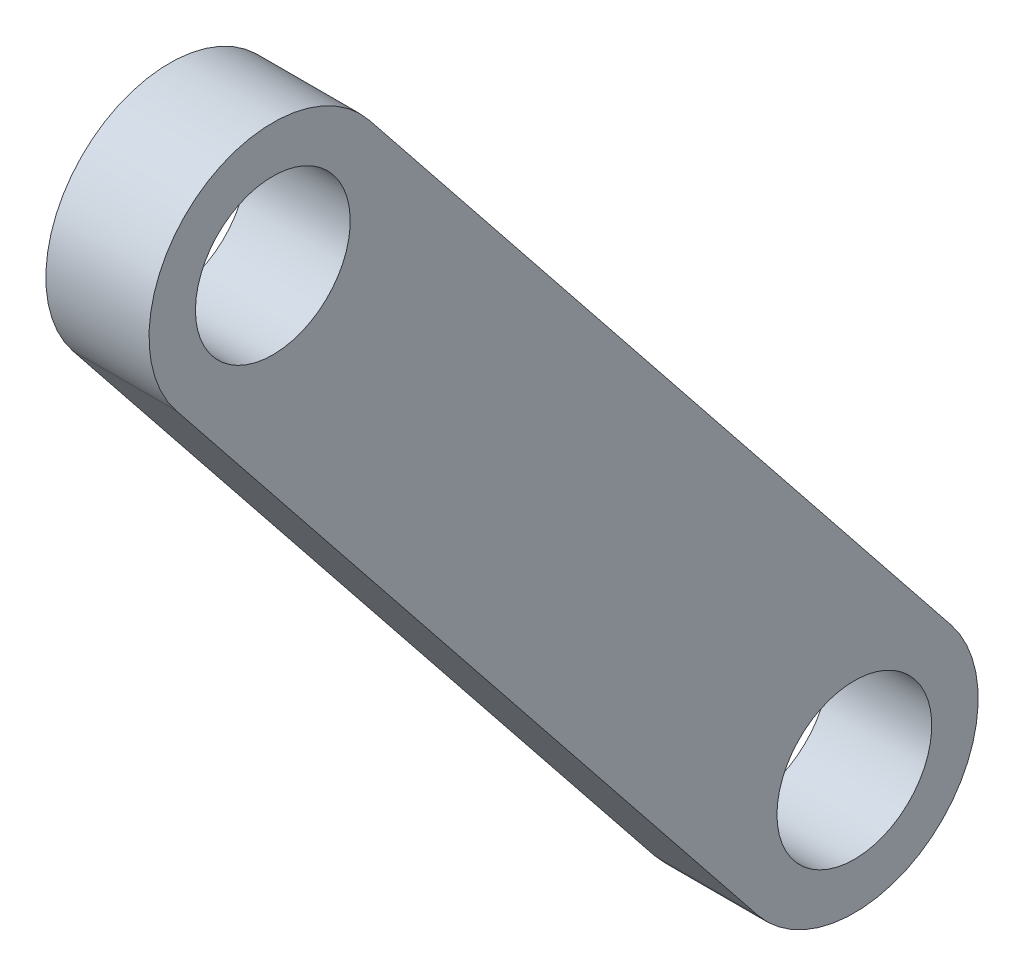
ISO-10303-21;
HEADER;
FILE_DESCRIPTION(('STEP AP214'),'2;1');
FILE_NAME('part.step','',(''),(''),'','','');
FILE_SCHEMA(('AUTOMOTIVE_DESIGN { 1 0 10303 214 1 1 1 1 }'));
ENDSEC;
DATA;
#1=APPLICATION_CONTEXT('core data for automotive mechanical design processes');
#2=APPLICATION_PROTOCOL_DEFINITION('international standard','automotive_design',2000,#1);
#3=PRODUCT_CONTEXT('',#1,'mechanical');
#4=PRODUCT('Part','Part','',(#3));
#5=PRODUCT_RELATED_PRODUCT_CATEGORY('part','',(#4));
#6=PRODUCT_DEFINITION_FORMATION('','',#4);
#7=PRODUCT_DEFINITION_CONTEXT('part definition',#1,'design');
#8=PRODUCT_DEFINITION('design','',#6,#7);
#9=PRODUCT_DEFINITION_SHAPE('','',#8);
#10=(LENGTH_UNIT() NAMED_UNIT(*) SI_UNIT(.MILLI.,.METRE.));
#11=(NAMED_UNIT(*) PLANE_ANGLE_UNIT() SI_UNIT($,.RADIAN.));
#12=(NAMED_UNIT(*) SI_UNIT($,.STERADIAN.) SOLID_ANGLE_UNIT());
#13=UNCERTAINTY_MEASURE_WITH_UNIT(LENGTH_MEASURE(1.E-05),#10,'distance_accuracy_value','');
#14=(GEOMETRIC_REPRESENTATION_CONTEXT(3) GLOBAL_UNCERTAINTY_ASSIGNED_CONTEXT((#13)) GLOBAL_UNIT_ASSIGNED_CONTEXT((#10,
#11,#12)) REPRESENTATION_CONTEXT('',''));
#15=CARTESIAN_POINT('',(0.,0.,0.));
#16=DIRECTION('',(0.,0.,1.));
#17=DIRECTION('',(1.,0.,0.));
#18=AXIS2_PLACEMENT_3D('',#15,#16,#17);
#19=CARTESIAN_POINT('',(1699.99999999996,5550.11623000931,-4431.25255969028));
#20=DIRECTION('',(1.,0.,0.));
#21=DIRECTION('',(0.,0.586791313624978,0.809738201059005));
#22=AXIS2_PLACEMENT_3D('',#19,#20,#21);
#23=PLANE('',#22);
#24=DIRECTION('',(0.,0.781191492489702,0.624291480048952));
#25=VECTOR('',#24,1.);
#26=CARTESIAN_POINT('',(1699.99999999996,4769.94531848226,-4901.11693555354));
#27=LINE('',#26,#25);
#28=CARTESIAN_POINT('',(1699.99999999996,4769.94531848226,-4901.11693555354));
#29=VERTEX_POINT('',#28);
#30=CARTESIAN_POINT('',(1699.99999999996,5475.20125240344,-4337.50958059151));
#31=VERTEX_POINT('',#30);
#32=EDGE_CURVE('E53',#29,#31,#27,.T.);
#33=ORIENTED_EDGE('',*,*,#32,.T.);
#34=CARTESIAN_POINT('',(1699.99999999996,5550.11623000931,-4431.25255969027));
#35=DIRECTION('',(1.,0.,0.));
#36=DIRECTION('',(0.,0.586791313624978,0.809738201059005));
#37=AXIS2_PLACEMENT_3D('',#34,#35,#36);
#38=CIRCLE('',#37,120.);
#39=CARTESIAN_POINT('',(1699.99999999996,5625.03120761519,-4524.99553878904));
#40=VERTEX_POINT('',#39);
#41=EDGE_CURVE('E70',#40,#31,#38,.T.);
#42=ORIENTED_EDGE('',*,*,#41,.F.);
#43=DIRECTION('',(0.,0.781191492489703,0.624291480048952));
#44=VECTOR('',#43,1.);
#45=CARTESIAN_POINT('',(1699.99999999996,4919.77527369401,-5088.60289375107));
#46=LINE('',#45,#44);
#47=CARTESIAN_POINT('',(1699.99999999996,4919.77527369401,-5088.60289375107));
#48=VERTEX_POINT('',#47);
#49=EDGE_CURVE('E67',#48,#40,#46,.T.);
#50=ORIENTED_EDGE('',*,*,#49,.F.);
#51=CARTESIAN_POINT('',(1699.99999999996,4844.86029608813,-4994.8599146523));
#52=DIRECTION('',(1.,0.,0.));
#53=DIRECTION('',(0.,0.586791313624978,0.809738201059005));
#54=AXIS2_PLACEMENT_3D('',#51,#52,#53);
#55=CIRCLE('',#54,120.);
#56=EDGE_CURVE('E58',#29,#48,#55,.T.);
#57=ORIENTED_EDGE('',*,*,#56,.F.);
#58=EDGE_LOOP('',(#33,#42,#50,#57));
#59=FACE_BOUND('',#58,.T.);
#60=CARTESIAN_POINT('',(1699.99999999996,4844.86029608813,-4994.8599146523));
#61=DIRECTION('',(1.,0.,0.));
#62=DIRECTION('',(0.,0.586791313624978,0.809738201059005));
#63=AXIS2_PLACEMENT_3D('',#60,#61,#62);
#64=CIRCLE('',#63,75.0000000000072);
#65=CARTESIAN_POINT('',(1699.99999999996,4888.86964461001,-4934.12954957287));
#66=VERTEX_POINT('',#65);
#67=EDGE_CURVE('E80',#66,#66,#64,.T.);
#68=ORIENTED_EDGE('',*,*,#67,.T.);
#69=EDGE_LOOP('',(#68));
#70=FACE_BOUND('',#69,.T.);
#71=CARTESIAN_POINT('',(1699.99999999996,5550.11623000931,-4431.25255969028));
#72=DIRECTION('',(1.,0.,0.));
#73=DIRECTION('',(0.,0.586791313624978,0.809738201059005));
#74=AXIS2_PLACEMENT_3D('',#71,#72,#73);
#75=CIRCLE('',#74,75.0000000000001);
#76=CARTESIAN_POINT('',(1699.99999999996,5594.12557853119,-4370.52219461085));
#77=VERTEX_POINT('',#76);
#78=EDGE_CURVE('E19',#77,#77,#75,.T.);
#79=ORIENTED_EDGE('',*,*,#78,.T.);
#80=EDGE_LOOP('',(#79));
#81=FACE_BOUND('',#80,.T.);
#82=ADVANCED_FACE('F16',(#59,#70,#81),#23,.F.);
#83=CARTESIAN_POINT('',(1699.99999999996,5550.11623000931,-4431.25255969028));
#84=DIRECTION('',(1.,0.,0.));
#85=DIRECTION('',(0.,0.586791313624978,0.809738201059005));
#86=AXIS2_PLACEMENT_3D('',#83,#84,#85);
#87=CYLINDRICAL_SURFACE('',#86,75.0000000000001);
#88=CARTESIAN_POINT('',(1799.99999999996,5550.11623000931,-4431.25255969027));
#89=DIRECTION('',(1.,0.,0.));
#90=DIRECTION('',(0.,0.586791313624978,0.809738201059005));
#91=AXIS2_PLACEMENT_3D('',#88,#89,#90);
#92=CIRCLE('',#91,75.0000000000001);
#93=CARTESIAN_POINT('',(1799.99999999996,5594.12557853119,-4370.52219461085));
#94=VERTEX_POINT('',#93);
#95=EDGE_CURVE('E88',#94,#94,#92,.F.);
#96=ORIENTED_EDGE('',*,*,#95,.F.);
#97=EDGE_LOOP('',(#96));
#98=FACE_BOUND('',#97,.T.);
#99=ORIENTED_EDGE('',*,*,#78,.F.);
#100=EDGE_LOOP('',(#99));
#101=FACE_BOUND('',#100,.T.);
#102=ADVANCED_FACE('F98',(#98,#101),#87,.F.);
#103=CARTESIAN_POINT('',(1699.99999999996,4844.86029608813,-4994.8599146523));
#104=DIRECTION('',(1.,0.,0.));
#105=DIRECTION('',(0.,0.586791313624978,0.809738201059005));
#106=AXIS2_PLACEMENT_3D('',#103,#104,#105);
#107=CYLINDRICAL_SURFACE('',#106,75.0000000000072);
#108=CARTESIAN_POINT('',(1799.99999999996,4844.86029608813,-4994.8599146523));
#109=DIRECTION('',(1.,0.,0.));
#110=DIRECTION('',(0.,0.586791313624978,0.809738201059005));
#111=AXIS2_PLACEMENT_3D('',#108,#109,#110);
#112=CIRCLE('',#111,75.0000000000072);
#113=CARTESIAN_POINT('',(1799.99999999996,4888.86964461001,-4934.12954957287));
#114=VERTEX_POINT('',#113);
#115=EDGE_CURVE('E85',#114,#114,#112,.F.);
#116=ORIENTED_EDGE('',*,*,#115,.F.);
#117=EDGE_LOOP('',(#116));
#118=FACE_BOUND('',#117,.T.);
#119=ORIENTED_EDGE('',*,*,#67,.F.);
#120=EDGE_LOOP('',(#119));
#121=FACE_BOUND('',#120,.T.);
#122=ADVANCED_FACE('F100',(#118,#121),#107,.F.);
#123=CARTESIAN_POINT('',(1699.99999999996,-35.5179925257809,-8741.41708166617));
#124=DIRECTION('',(0.,0.624291480048952,-0.781191492489703));
#125=DIRECTION('',(-0.000222778985371762,0.781191473104249,0.62429146455701));
#126=AXIS2_PLACEMENT_3D('',#123,#124,#125);
#127=PLANE('',#126);
#128=DIRECTION('',(1.,0.,0.));
#129=VECTOR('',#128,1.);
#130=CARTESIAN_POINT('',(1699.99999999996,5475.20125240344,-4337.50958059151));
#131=LINE('',#130,#129);
#132=CARTESIAN_POINT('',(1799.99999999996,5475.20125240344,-4337.50958059151));
#133=VERTEX_POINT('',#132);
#134=EDGE_CURVE('E91',#31,#133,#131,.T.);
#135=ORIENTED_EDGE('',*,*,#134,.F.);
#136=ORIENTED_EDGE('',*,*,#32,.F.);
#137=DIRECTION('',(1.,0.,0.));
#138=VECTOR('',#137,1.);
#139=CARTESIAN_POINT('',(1699.99999999996,4769.94531848226,-4901.11693555354));
#140=LINE('',#139,#138);
#141=CARTESIAN_POINT('',(1799.99999999996,4769.94531848226,-4901.11693555354));
#142=VERTEX_POINT('',#141);
#143=EDGE_CURVE('E64',#142,#29,#140,.F.);
#144=ORIENTED_EDGE('',*,*,#143,.F.);
#145=DIRECTION('',(0.,-0.781191492489703,-0.624291480048952));
#146=VECTOR('',#145,1.);
#147=CARTESIAN_POINT('',(1799.99999999996,5475.20125240344,-4337.50958059151));
#148=LINE('',#147,#146);
#149=EDGE_CURVE('E84',#133,#142,#148,.T.);
#150=ORIENTED_EDGE('',*,*,#149,.F.);
#151=EDGE_LOOP('',(#135,#136,#144,#150));
#152=FACE_BOUND('',#151,.T.);
#153=ADVANCED_FACE('F107',(#152),#127,.F.);
#154=CARTESIAN_POINT('',(1699.99999999996,4844.86029608813,-4994.8599146523));
#155=DIRECTION('',(1.,0.,0.));
#156=DIRECTION('',(0.,0.586791313624978,0.809738201059005));
#157=AXIS2_PLACEMENT_3D('',#154,#155,#156);
#158=CYLINDRICAL_SURFACE('',#157,120.);
#159=ORIENTED_EDGE('',*,*,#56,.T.);
#160=DIRECTION('',(-1.,0.,0.));
#161=VECTOR('',#160,1.);
#162=CARTESIAN_POINT('',(1799.99999999996,4919.77527369401,-5088.60289375107));
#163=LINE('',#162,#161);
#164=CARTESIAN_POINT('',(1799.99999999996,4919.77527369401,-5088.60289375107));
#165=VERTEX_POINT('',#164);
#166=EDGE_CURVE('E63',#165,#48,#163,.T.);
#167=ORIENTED_EDGE('',*,*,#166,.F.);
#168=CARTESIAN_POINT('',(1799.99999999996,4844.86029608813,-4994.8599146523));
#169=DIRECTION('',(1.,0.,0.));
#170=DIRECTION('',(0.,0.586791313624978,0.809738201059005));
#171=AXIS2_PLACEMENT_3D('',#168,#169,#170);
#172=CIRCLE('',#171,120.);
#173=EDGE_CURVE('E82',#142,#165,#172,.T.);
#174=ORIENTED_EDGE('',*,*,#173,.F.);
#175=ORIENTED_EDGE('',*,*,#143,.T.);
#176=EDGE_LOOP('',(#159,#167,#174,#175));
#177=FACE_BOUND('',#176,.T.);
#178=ADVANCED_FACE('F60',(#177),#158,.T.);
#179=CARTESIAN_POINT('',(1699.99999999996,114.311962685968,-8928.9030398637));
#180=DIRECTION('',(0.,0.624291480048952,-0.781191492489703));
#181=DIRECTION('',(-0.000222778985371762,0.781191473104249,0.62429146455701));
#182=AXIS2_PLACEMENT_3D('',#179,#180,#181);
#183=PLANE('',#182);
#184=ORIENTED_EDGE('',*,*,#49,.T.);
#185=DIRECTION('',(1.,0.,0.));
#186=VECTOR('',#185,1.);
#187=CARTESIAN_POINT('',(1699.99999999996,5625.03120761519,-4524.99553878904));
#188=LINE('',#187,#186);
#189=CARTESIAN_POINT('',(1799.99999999996,5625.03120761519,-4524.99553878904));
#190=VERTEX_POINT('',#189);
#191=EDGE_CURVE('E34',#190,#40,#188,.F.);
#192=ORIENTED_EDGE('',*,*,#191,.F.);
#193=DIRECTION('',(0.,0.781191492489703,0.624291480048952));
#194=VECTOR('',#193,1.);
#195=CARTESIAN_POINT('',(1799.99999999996,4919.77527369401,-5088.60289375107));
#196=LINE('',#195,#194);
#197=EDGE_CURVE('E25',#165,#190,#196,.T.);
#198=ORIENTED_EDGE('',*,*,#197,.F.);
#199=ORIENTED_EDGE('',*,*,#166,.T.);
#200=EDGE_LOOP('',(#184,#192,#198,#199));
#201=FACE_BOUND('',#200,.T.);
#202=ADVANCED_FACE('F72',(#201),#183,.T.);
#203=CARTESIAN_POINT('',(1699.99999999996,5550.11623000931,-4431.25255969027));
#204=DIRECTION('',(1.,0.,0.));
#205=DIRECTION('',(0.,0.586791313624978,0.809738201059005));
#206=AXIS2_PLACEMENT_3D('',#203,#204,#205);
#207=CYLINDRICAL_SURFACE('',#206,120.);
#208=ORIENTED_EDGE('',*,*,#134,.T.);
#209=CARTESIAN_POINT('',(1799.99999999996,5550.11623000931,-4431.25255969027));
#210=DIRECTION('',(1.,0.,0.));
#211=DIRECTION('',(0.,0.586791313624978,0.809738201059005));
#212=AXIS2_PLACEMENT_3D('',#209,#210,#211);
#213=CIRCLE('',#212,120.);
#214=EDGE_CURVE('E10',#190,#133,#213,.T.);
#215=ORIENTED_EDGE('',*,*,#214,.F.);
#216=ORIENTED_EDGE('',*,*,#191,.T.);
#217=ORIENTED_EDGE('',*,*,#41,.T.);
#218=EDGE_LOOP('',(#208,#215,#216,#217));
#219=FACE_BOUND('',#218,.T.);
#220=ADVANCED_FACE('F113',(#219),#207,.T.);
#221=CARTESIAN_POINT('',(1799.99999999996,5550.11623000931,-4431.25255969027));
#222=DIRECTION('',(1.,0.,0.));
#223=DIRECTION('',(0.,0.586791313624978,0.809738201059005));
#224=AXIS2_PLACEMENT_3D('',#221,#222,#223);
#225=PLANE('',#224);
#226=ORIENTED_EDGE('',*,*,#214,.T.);
#227=ORIENTED_EDGE('',*,*,#149,.T.);
#228=ORIENTED_EDGE('',*,*,#173,.T.);
#229=ORIENTED_EDGE('',*,*,#197,.T.);
#230=EDGE_LOOP('',(#226,#227,#228,#229));
#231=FACE_BOUND('',#230,.T.);
#232=ORIENTED_EDGE('',*,*,#115,.T.);
#233=EDGE_LOOP('',(#232));
#234=FACE_BOUND('',#233,.T.);
#235=ORIENTED_EDGE('',*,*,#95,.T.);
#236=EDGE_LOOP('',(#235));
#237=FACE_BOUND('',#236,.T.);
#238=ADVANCED_FACE('F111',(#231,#234,#237),#225,.T.);
#239=CLOSED_SHELL('',(#82,#102,#122,#153,#178,#202,#220,#238));
#240=MANIFOLD_SOLID_BREP('B1',#239);
#241=ADVANCED_BREP_SHAPE_REPRESENTATION('',(#18,#240),#14);
#242=SHAPE_DEFINITION_REPRESENTATION(#9,#241);
ENDSEC;
END-ISO-10303-21;
